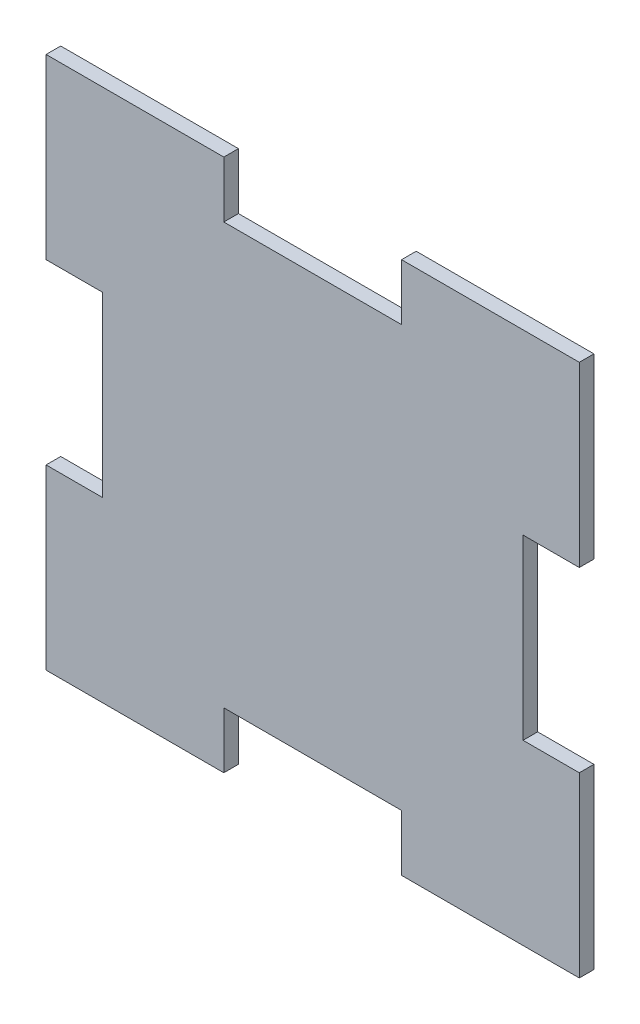
ISO-10303-21;
HEADER;
FILE_DESCRIPTION(('STEP AP214'),'2;1');
FILE_NAME('part.step','',(''),(''),'','','');
FILE_SCHEMA(('AUTOMOTIVE_DESIGN { 1 0 10303 214 1 1 1 1 }'));
ENDSEC;
DATA;
#1=APPLICATION_CONTEXT('core data for automotive mechanical design processes');
#2=APPLICATION_PROTOCOL_DEFINITION('international standard','automotive_design',2000,#1);
#3=PRODUCT_CONTEXT('',#1,'mechanical');
#4=PRODUCT('Part','Part','',(#3));
#5=PRODUCT_RELATED_PRODUCT_CATEGORY('part','',(#4));
#6=PRODUCT_DEFINITION_FORMATION('','',#4);
#7=PRODUCT_DEFINITION_CONTEXT('part definition',#1,'design');
#8=PRODUCT_DEFINITION('design','',#6,#7);
#9=PRODUCT_DEFINITION_SHAPE('','',#8);
#10=(LENGTH_UNIT() NAMED_UNIT(*) SI_UNIT(.MILLI.,.METRE.));
#11=(NAMED_UNIT(*) PLANE_ANGLE_UNIT() SI_UNIT($,.RADIAN.));
#12=(NAMED_UNIT(*) SI_UNIT($,.STERADIAN.) SOLID_ANGLE_UNIT());
#13=UNCERTAINTY_MEASURE_WITH_UNIT(LENGTH_MEASURE(1.E-05),#10,'distance_accuracy_value','');
#14=(GEOMETRIC_REPRESENTATION_CONTEXT(3) GLOBAL_UNCERTAINTY_ASSIGNED_CONTEXT((#13)) GLOBAL_UNIT_ASSIGNED_CONTEXT((#10,
#11,#12)) REPRESENTATION_CONTEXT('',''));
#15=CARTESIAN_POINT('',(0.,0.,0.));
#16=DIRECTION('',(0.,0.,1.));
#17=DIRECTION('',(1.,0.,0.));
#18=AXIS2_PLACEMENT_3D('',#15,#16,#17);
#19=CARTESIAN_POINT('',(95.9203819214755,2.31764716104696,2.6));
#20=DIRECTION('',(0.,1.,0.));
#21=DIRECTION('',(-1.,0.,0.));
#22=AXIS2_PLACEMENT_3D('',#19,#20,#21);
#23=PLANE('',#22);
#24=DIRECTION('',(1.,0.,0.));
#25=VECTOR('',#24,1.);
#26=CARTESIAN_POINT('',(95.9203819214755,2.31764716104696,0.));
#27=LINE('',#26,#25);
#28=CARTESIAN_POINT('',(1.1203819214755,2.31764716104696,0.));
#29=VERTEX_POINT('',#28);
#30=CARTESIAN_POINT('',(32.7203819214755,2.31764716104697,0.));
#31=VERTEX_POINT('',#30);
#32=EDGE_CURVE('E183',#29,#31,#27,.T.);
#33=ORIENTED_EDGE('',*,*,#32,.T.);
#34=DIRECTION('',(0.,0.,1.));
#35=VECTOR('',#34,1.);
#36=CARTESIAN_POINT('',(32.7203819214755,2.31764716104697,0.));
#37=LINE('',#36,#35);
#38=CARTESIAN_POINT('',(32.7203819214755,2.31764716104697,2.6));
#39=VERTEX_POINT('',#38);
#40=EDGE_CURVE('E167',#31,#39,#37,.T.);
#41=ORIENTED_EDGE('',*,*,#40,.T.);
#42=DIRECTION('',(1.,0.,0.));
#43=VECTOR('',#42,1.);
#44=CARTESIAN_POINT('',(1.1203819214755,2.31764716104696,2.6));
#45=LINE('',#44,#43);
#46=CARTESIAN_POINT('',(1.1203819214755,2.31764716104696,2.6));
#47=VERTEX_POINT('',#46);
#48=EDGE_CURVE('E203',#47,#39,#45,.T.);
#49=ORIENTED_EDGE('',*,*,#48,.F.);
#50=DIRECTION('',(0.,0.,-1.));
#51=VECTOR('',#50,1.);
#52=CARTESIAN_POINT('',(1.1203819214755,2.31764716104696,2.6));
#53=LINE('',#52,#51);
#54=EDGE_CURVE('E190',#47,#29,#53,.T.);
#55=ORIENTED_EDGE('',*,*,#54,.T.);
#56=EDGE_LOOP('',(#33,#41,#49,#55));
#57=FACE_BOUND('',#56,.T.);
#58=ADVANCED_FACE('F30',(#57),#23,.F.);
#59=CARTESIAN_POINT('',(1.1203819214755,97.117647161047,2.6));
#60=DIRECTION('',(0.,-1.,0.));
#61=DIRECTION('',(1.,0.,0.));
#62=AXIS2_PLACEMENT_3D('',#59,#60,#61);
#63=PLANE('',#62);
#64=DIRECTION('',(-1.,0.,0.));
#65=VECTOR('',#64,1.);
#66=CARTESIAN_POINT('',(95.9203819214755,97.117647161047,2.6));
#67=LINE('',#66,#65);
#68=CARTESIAN_POINT('',(32.7203819214755,97.117647161047,2.6));
#69=VERTEX_POINT('',#68);
#70=CARTESIAN_POINT('',(1.1203819214755,97.117647161047,2.6));
#71=VERTEX_POINT('',#70);
#72=EDGE_CURVE('E218',#69,#71,#67,.T.);
#73=ORIENTED_EDGE('',*,*,#72,.F.);
#74=DIRECTION('',(0.,0.,1.));
#75=VECTOR('',#74,1.);
#76=CARTESIAN_POINT('',(32.7203819214755,97.117647161047,0.));
#77=LINE('',#76,#75);
#78=CARTESIAN_POINT('',(32.7203819214755,97.117647161047,0.));
#79=VERTEX_POINT('',#78);
#80=EDGE_CURVE('E221',#79,#69,#77,.T.);
#81=ORIENTED_EDGE('',*,*,#80,.F.);
#82=DIRECTION('',(-1.,0.,0.));
#83=VECTOR('',#82,1.);
#84=CARTESIAN_POINT('',(1.1203819214755,97.117647161047,0.));
#85=LINE('',#84,#83);
#86=CARTESIAN_POINT('',(1.1203819214755,97.117647161047,0.));
#87=VERTEX_POINT('',#86);
#88=EDGE_CURVE('E220',#79,#87,#85,.T.);
#89=ORIENTED_EDGE('',*,*,#88,.T.);
#90=DIRECTION('',(0.,0.,-1.));
#91=VECTOR('',#90,1.);
#92=CARTESIAN_POINT('',(1.1203819214755,97.117647161047,2.6));
#93=LINE('',#92,#91);
#94=EDGE_CURVE('E38',#71,#87,#93,.T.);
#95=ORIENTED_EDGE('',*,*,#94,.F.);
#96=EDGE_LOOP('',(#73,#81,#89,#95));
#97=FACE_BOUND('',#96,.T.);
#98=ADVANCED_FACE('F216',(#97),#63,.F.);
#99=CARTESIAN_POINT('',(1.1203819214755,2.31764716104696,2.6));
#100=DIRECTION('',(1.,0.,0.));
#101=DIRECTION('',(0.,1.,0.));
#102=AXIS2_PLACEMENT_3D('',#99,#100,#101);
#103=PLANE('',#102);
#104=DIRECTION('',(0.,-1.,0.));
#105=VECTOR('',#104,1.);
#106=CARTESIAN_POINT('',(1.1203819214755,97.117647161047,2.6));
#107=LINE('',#106,#105);
#108=CARTESIAN_POINT('',(1.1203819214755,33.917647161047,2.6));
#109=VERTEX_POINT('',#108);
#110=EDGE_CURVE('E242',#109,#47,#107,.T.);
#111=ORIENTED_EDGE('',*,*,#110,.F.);
#112=DIRECTION('',(0.,0.,1.));
#113=VECTOR('',#112,1.);
#114=CARTESIAN_POINT('',(1.1203819214755,33.917647161047,0.));
#115=LINE('',#114,#113);
#116=CARTESIAN_POINT('',(1.1203819214755,33.917647161047,0.));
#117=VERTEX_POINT('',#116);
#118=EDGE_CURVE('E266',#117,#109,#115,.T.);
#119=ORIENTED_EDGE('',*,*,#118,.F.);
#120=DIRECTION('',(0.,-1.,0.));
#121=VECTOR('',#120,1.);
#122=CARTESIAN_POINT('',(1.1203819214755,2.31764716104696,0.));
#123=LINE('',#122,#121);
#124=EDGE_CURVE('E228',#117,#29,#123,.T.);
#125=ORIENTED_EDGE('',*,*,#124,.T.);
#126=ORIENTED_EDGE('',*,*,#54,.F.);
#127=EDGE_LOOP('',(#111,#119,#125,#126));
#128=FACE_BOUND('',#127,.T.);
#129=ADVANCED_FACE('F358',(#128),#103,.F.);
#130=CARTESIAN_POINT('',(95.9203819214755,97.117647161047,2.6));
#131=DIRECTION('',(-1.,0.,0.));
#132=DIRECTION('',(0.,-1.,0.));
#133=AXIS2_PLACEMENT_3D('',#130,#131,#132);
#134=PLANE('',#133);
#135=DIRECTION('',(0.,1.,0.));
#136=VECTOR('',#135,1.);
#137=CARTESIAN_POINT('',(95.9203819214755,32.237647161047,2.6));
#138=LINE('',#137,#136);
#139=CARTESIAN_POINT('',(95.9203819214755,65.517647161047,2.6));
#140=VERTEX_POINT('',#139);
#141=CARTESIAN_POINT('',(95.9203819214755,97.117647161047,2.6));
#142=VERTEX_POINT('',#141);
#143=EDGE_CURVE('E191',#140,#142,#138,.T.);
#144=ORIENTED_EDGE('',*,*,#143,.F.);
#145=DIRECTION('',(0.,0.,1.));
#146=VECTOR('',#145,1.);
#147=CARTESIAN_POINT('',(95.9203819214755,65.517647161047,0.));
#148=LINE('',#147,#146);
#149=CARTESIAN_POINT('',(95.9203819214755,65.517647161047,0.));
#150=VERTEX_POINT('',#149);
#151=EDGE_CURVE('E253',#150,#140,#148,.T.);
#152=ORIENTED_EDGE('',*,*,#151,.F.);
#153=DIRECTION('',(0.,1.,0.));
#154=VECTOR('',#153,1.);
#155=CARTESIAN_POINT('',(95.9203819214755,97.117647161047,0.));
#156=LINE('',#155,#154);
#157=CARTESIAN_POINT('',(95.9203819214755,97.117647161047,0.));
#158=VERTEX_POINT('',#157);
#159=EDGE_CURVE('E238',#150,#158,#156,.T.);
#160=ORIENTED_EDGE('',*,*,#159,.T.);
#161=DIRECTION('',(0.,0.,-1.));
#162=VECTOR('',#161,1.);
#163=CARTESIAN_POINT('',(95.9203819214755,97.117647161047,2.6));
#164=LINE('',#163,#162);
#165=EDGE_CURVE('E11',#142,#158,#164,.T.);
#166=ORIENTED_EDGE('',*,*,#165,.F.);
#167=EDGE_LOOP('',(#144,#152,#160,#166));
#168=FACE_BOUND('',#167,.T.);
#169=ADVANCED_FACE('F372',(#168),#134,.F.);
#170=CARTESIAN_POINT('',(95.9203819214755,2.31764716104696,0.));
#171=VERTEX_POINT('',#170);
#172=CARTESIAN_POINT('',(95.9203819214755,33.917647161047,0.));
#173=VERTEX_POINT('',#172);
#174=EDGE_CURVE('E224',#171,#173,#156,.T.);
#175=ORIENTED_EDGE('',*,*,#174,.T.);
#176=DIRECTION('',(0.,0.,1.));
#177=VECTOR('',#176,1.);
#178=CARTESIAN_POINT('',(95.9203819214755,33.917647161047,0.));
#179=LINE('',#178,#177);
#180=CARTESIAN_POINT('',(95.9203819214755,33.917647161047,2.6));
#181=VERTEX_POINT('',#180);
#182=EDGE_CURVE('E249',#173,#181,#179,.T.);
#183=ORIENTED_EDGE('',*,*,#182,.T.);
#184=CARTESIAN_POINT('',(95.9203819214755,2.31764716104696,2.6));
#185=VERTEX_POINT('',#184);
#186=EDGE_CURVE('E194',#185,#181,#138,.T.);
#187=ORIENTED_EDGE('',*,*,#186,.F.);
#188=DIRECTION('',(0.,0.,-1.));
#189=VECTOR('',#188,1.);
#190=CARTESIAN_POINT('',(95.9203819214755,2.31764716104696,2.6));
#191=LINE('',#190,#189);
#192=EDGE_CURVE('E200',#185,#171,#191,.T.);
#193=ORIENTED_EDGE('',*,*,#192,.T.);
#194=EDGE_LOOP('',(#175,#183,#187,#193));
#195=FACE_BOUND('',#194,.T.);
#196=ADVANCED_FACE('F32',(#195),#134,.F.);
#197=CARTESIAN_POINT('',(64.3203819214755,97.117647161047,0.));
#198=VERTEX_POINT('',#197);
#199=EDGE_CURVE('E223',#158,#198,#85,.T.);
#200=ORIENTED_EDGE('',*,*,#199,.T.);
#201=DIRECTION('',(0.,0.,1.));
#202=VECTOR('',#201,1.);
#203=CARTESIAN_POINT('',(64.3203819214755,97.117647161047,0.));
#204=LINE('',#203,#202);
#205=CARTESIAN_POINT('',(64.3203819214755,97.117647161047,2.6));
#206=VERTEX_POINT('',#205);
#207=EDGE_CURVE('E299',#198,#206,#204,.T.);
#208=ORIENTED_EDGE('',*,*,#207,.T.);
#209=EDGE_CURVE('E243',#142,#206,#67,.T.);
#210=ORIENTED_EDGE('',*,*,#209,.F.);
#211=ORIENTED_EDGE('',*,*,#165,.T.);
#212=EDGE_LOOP('',(#200,#208,#210,#211));
#213=FACE_BOUND('',#212,.T.);
#214=ADVANCED_FACE('F359',(#213),#63,.F.);
#215=CARTESIAN_POINT('',(1.1203819214755,65.517647161047,0.));
#216=VERTEX_POINT('',#215);
#217=EDGE_CURVE('E196',#87,#216,#123,.T.);
#218=ORIENTED_EDGE('',*,*,#217,.T.);
#219=DIRECTION('',(0.,0.,1.));
#220=VECTOR('',#219,1.);
#221=CARTESIAN_POINT('',(1.1203819214755,65.517647161047,0.));
#222=LINE('',#221,#220);
#223=CARTESIAN_POINT('',(1.1203819214755,65.517647161047,2.6));
#224=VERTEX_POINT('',#223);
#225=EDGE_CURVE('E278',#216,#224,#222,.T.);
#226=ORIENTED_EDGE('',*,*,#225,.T.);
#227=EDGE_CURVE('E213',#71,#224,#107,.T.);
#228=ORIENTED_EDGE('',*,*,#227,.F.);
#229=ORIENTED_EDGE('',*,*,#94,.T.);
#230=EDGE_LOOP('',(#218,#226,#228,#229));
#231=FACE_BOUND('',#230,.T.);
#232=ADVANCED_FACE('F209',(#231),#103,.F.);
#233=CARTESIAN_POINT('',(64.3203819214755,2.31764716104697,2.6));
#234=VERTEX_POINT('',#233);
#235=EDGE_CURVE('E240',#234,#185,#45,.T.);
#236=ORIENTED_EDGE('',*,*,#235,.F.);
#237=DIRECTION('',(0.,0.,1.));
#238=VECTOR('',#237,1.);
#239=CARTESIAN_POINT('',(64.3203819214755,2.31764716104697,0.));
#240=LINE('',#239,#238);
#241=CARTESIAN_POINT('',(64.3203819214755,2.31764716104697,0.));
#242=VERTEX_POINT('',#241);
#243=EDGE_CURVE('E177',#242,#234,#240,.T.);
#244=ORIENTED_EDGE('',*,*,#243,.F.);
#245=EDGE_CURVE('E192',#242,#171,#27,.T.);
#246=ORIENTED_EDGE('',*,*,#245,.T.);
#247=ORIENTED_EDGE('',*,*,#192,.F.);
#248=EDGE_LOOP('',(#236,#244,#246,#247));
#249=FACE_BOUND('',#248,.T.);
#250=ADVANCED_FACE('F336',(#249),#23,.F.);
#251=CARTESIAN_POINT('',(95.9203819214755,2.31764716104696,2.6));
#252=DIRECTION('',(0.,0.,-1.));
#253=DIRECTION('',(-1.,0.,0.));
#254=AXIS2_PLACEMENT_3D('',#251,#252,#253);
#255=PLANE('',#254);
#256=ORIENTED_EDGE('',*,*,#48,.T.);
#257=DIRECTION('',(0.,-1.,0.));
#258=VECTOR('',#257,1.);
#259=CARTESIAN_POINT('',(32.7203819214755,2.31764716104697,2.6));
#260=LINE('',#259,#258);
#261=CARTESIAN_POINT('',(32.7203819214755,12.317647161047,2.6));
#262=VERTEX_POINT('',#261);
#263=EDGE_CURVE('E172',#262,#39,#260,.T.);
#264=ORIENTED_EDGE('',*,*,#263,.F.);
#265=DIRECTION('',(-1.,0.,0.));
#266=VECTOR('',#265,1.);
#267=CARTESIAN_POINT('',(32.7203819214755,12.317647161047,2.6));
#268=LINE('',#267,#266);
#269=CARTESIAN_POINT('',(64.3203819214755,12.317647161047,2.6));
#270=VERTEX_POINT('',#269);
#271=EDGE_CURVE('E187',#270,#262,#268,.T.);
#272=ORIENTED_EDGE('',*,*,#271,.F.);
#273=DIRECTION('',(0.,1.,0.));
#274=VECTOR('',#273,1.);
#275=CARTESIAN_POINT('',(64.3203819214755,2.31764716104697,2.6));
#276=LINE('',#275,#274);
#277=EDGE_CURVE('E323',#234,#270,#276,.T.);
#278=ORIENTED_EDGE('',*,*,#277,.F.);
#279=ORIENTED_EDGE('',*,*,#235,.T.);
#280=ORIENTED_EDGE('',*,*,#186,.T.);
#281=DIRECTION('',(1.,0.,0.));
#282=VECTOR('',#281,1.);
#283=CARTESIAN_POINT('',(95.9203819214755,33.917647161047,2.6));
#284=LINE('',#283,#282);
#285=CARTESIAN_POINT('',(85.9203819214755,33.917647161047,2.6));
#286=VERTEX_POINT('',#285);
#287=EDGE_CURVE('E261',#286,#181,#284,.T.);
#288=ORIENTED_EDGE('',*,*,#287,.F.);
#289=DIRECTION('',(0.,-1.,0.));
#290=VECTOR('',#289,1.);
#291=CARTESIAN_POINT('',(85.9203819214755,33.917647161047,2.6));
#292=LINE('',#291,#290);
#293=CARTESIAN_POINT('',(85.9203819214755,65.517647161047,2.6));
#294=VERTEX_POINT('',#293);
#295=EDGE_CURVE('E263',#294,#286,#292,.T.);
#296=ORIENTED_EDGE('',*,*,#295,.F.);
#297=DIRECTION('',(-1.,0.,0.));
#298=VECTOR('',#297,1.);
#299=CARTESIAN_POINT('',(95.9203819214755,65.517647161047,2.6));
#300=LINE('',#299,#298);
#301=EDGE_CURVE('E257',#140,#294,#300,.T.);
#302=ORIENTED_EDGE('',*,*,#301,.F.);
#303=ORIENTED_EDGE('',*,*,#143,.T.);
#304=ORIENTED_EDGE('',*,*,#209,.T.);
#305=DIRECTION('',(0.,1.,0.));
#306=VECTOR('',#305,1.);
#307=CARTESIAN_POINT('',(64.3203819214755,97.117647161047,2.6));
#308=LINE('',#307,#306);
#309=CARTESIAN_POINT('',(64.3203819214755,87.117647161047,2.6));
#310=VERTEX_POINT('',#309);
#311=EDGE_CURVE('E302',#310,#206,#308,.T.);
#312=ORIENTED_EDGE('',*,*,#311,.F.);
#313=DIRECTION('',(1.,0.,0.));
#314=VECTOR('',#313,1.);
#315=CARTESIAN_POINT('',(32.7203819214755,87.117647161047,2.6));
#316=LINE('',#315,#314);
#317=CARTESIAN_POINT('',(32.7203819214755,87.117647161047,2.6));
#318=VERTEX_POINT('',#317);
#319=EDGE_CURVE('E305',#318,#310,#316,.T.);
#320=ORIENTED_EDGE('',*,*,#319,.F.);
#321=DIRECTION('',(0.,-1.,0.));
#322=VECTOR('',#321,1.);
#323=CARTESIAN_POINT('',(32.7203819214755,97.117647161047,2.6));
#324=LINE('',#323,#322);
#325=EDGE_CURVE('E308',#69,#318,#324,.T.);
#326=ORIENTED_EDGE('',*,*,#325,.F.);
#327=ORIENTED_EDGE('',*,*,#72,.T.);
#328=ORIENTED_EDGE('',*,*,#227,.T.);
#329=DIRECTION('',(-1.,0.,0.));
#330=VECTOR('',#329,1.);
#331=CARTESIAN_POINT('',(1.1203819214755,65.517647161047,2.6));
#332=LINE('',#331,#330);
#333=CARTESIAN_POINT('',(11.1203819214755,65.517647161047,2.6));
#334=VERTEX_POINT('',#333);
#335=EDGE_CURVE('E281',#334,#224,#332,.T.);
#336=ORIENTED_EDGE('',*,*,#335,.F.);
#337=DIRECTION('',(0.,1.,0.));
#338=VECTOR('',#337,1.);
#339=CARTESIAN_POINT('',(11.1203819214755,33.917647161047,2.6));
#340=LINE('',#339,#338);
#341=CARTESIAN_POINT('',(11.1203819214755,33.917647161047,2.6));
#342=VERTEX_POINT('',#341);
#343=EDGE_CURVE('E284',#342,#334,#340,.T.);
#344=ORIENTED_EDGE('',*,*,#343,.F.);
#345=DIRECTION('',(1.,0.,0.));
#346=VECTOR('',#345,1.);
#347=CARTESIAN_POINT('',(1.1203819214755,33.917647161047,2.6));
#348=LINE('',#347,#346);
#349=EDGE_CURVE('E287',#109,#342,#348,.T.);
#350=ORIENTED_EDGE('',*,*,#349,.F.);
#351=ORIENTED_EDGE('',*,*,#110,.T.);
#352=EDGE_LOOP('',(#256,#264,#272,#278,#279,#280,#288,#296,#302,#303,#304,#312,#320,#326,#327,
#328,#336,#344,#350,#351));
#353=FACE_BOUND('',#352,.T.);
#354=ADVANCED_FACE('F340',(#353),#255,.F.);
#355=CARTESIAN_POINT('',(95.9203819214755,2.31764716104696,0.));
#356=DIRECTION('',(0.,0.,-1.));
#357=DIRECTION('',(-1.,0.,0.));
#358=AXIS2_PLACEMENT_3D('',#355,#356,#357);
#359=PLANE('',#358);
#360=DIRECTION('',(0.,-1.,0.));
#361=VECTOR('',#360,1.);
#362=CARTESIAN_POINT('',(32.7203819214755,2.31764716104697,0.));
#363=LINE('',#362,#361);
#364=CARTESIAN_POINT('',(32.7203819214755,12.317647161047,0.));
#365=VERTEX_POINT('',#364);
#366=EDGE_CURVE('E170',#365,#31,#363,.T.);
#367=ORIENTED_EDGE('',*,*,#366,.T.);
#368=ORIENTED_EDGE('',*,*,#32,.F.);
#369=ORIENTED_EDGE('',*,*,#124,.F.);
#370=DIRECTION('',(1.,0.,0.));
#371=VECTOR('',#370,1.);
#372=CARTESIAN_POINT('',(1.1203819214755,33.917647161047,0.));
#373=LINE('',#372,#371);
#374=CARTESIAN_POINT('',(11.1203819214755,33.917647161047,0.));
#375=VERTEX_POINT('',#374);
#376=EDGE_CURVE('E283',#117,#375,#373,.T.);
#377=ORIENTED_EDGE('',*,*,#376,.T.);
#378=DIRECTION('',(0.,1.,0.));
#379=VECTOR('',#378,1.);
#380=CARTESIAN_POINT('',(11.1203819214755,33.917647161047,0.));
#381=LINE('',#380,#379);
#382=CARTESIAN_POINT('',(11.1203819214755,65.517647161047,0.));
#383=VERTEX_POINT('',#382);
#384=EDGE_CURVE('E291',#375,#383,#381,.T.);
#385=ORIENTED_EDGE('',*,*,#384,.T.);
#386=DIRECTION('',(-1.,0.,0.));
#387=VECTOR('',#386,1.);
#388=CARTESIAN_POINT('',(1.1203819214755,65.517647161047,0.));
#389=LINE('',#388,#387);
#390=EDGE_CURVE('E227',#383,#216,#389,.T.);
#391=ORIENTED_EDGE('',*,*,#390,.T.);
#392=ORIENTED_EDGE('',*,*,#217,.F.);
#393=ORIENTED_EDGE('',*,*,#88,.F.);
#394=DIRECTION('',(0.,-1.,0.));
#395=VECTOR('',#394,1.);
#396=CARTESIAN_POINT('',(32.7203819214755,97.117647161047,0.));
#397=LINE('',#396,#395);
#398=CARTESIAN_POINT('',(32.7203819214755,87.117647161047,0.));
#399=VERTEX_POINT('',#398);
#400=EDGE_CURVE('E304',#79,#399,#397,.T.);
#401=ORIENTED_EDGE('',*,*,#400,.T.);
#402=DIRECTION('',(1.,0.,0.));
#403=VECTOR('',#402,1.);
#404=CARTESIAN_POINT('',(32.7203819214755,87.117647161047,0.));
#405=LINE('',#404,#403);
#406=CARTESIAN_POINT('',(64.3203819214755,87.117647161047,0.));
#407=VERTEX_POINT('',#406);
#408=EDGE_CURVE('E313',#399,#407,#405,.T.);
#409=ORIENTED_EDGE('',*,*,#408,.T.);
#410=DIRECTION('',(0.,1.,0.));
#411=VECTOR('',#410,1.);
#412=CARTESIAN_POINT('',(64.3203819214755,97.117647161047,0.));
#413=LINE('',#412,#411);
#414=EDGE_CURVE('E53',#407,#198,#413,.T.);
#415=ORIENTED_EDGE('',*,*,#414,.T.);
#416=ORIENTED_EDGE('',*,*,#199,.F.);
#417=ORIENTED_EDGE('',*,*,#159,.F.);
#418=DIRECTION('',(-1.,0.,0.));
#419=VECTOR('',#418,1.);
#420=CARTESIAN_POINT('',(95.9203819214755,65.517647161047,0.));
#421=LINE('',#420,#419);
#422=CARTESIAN_POINT('',(85.9203819214755,65.517647161047,0.));
#423=VERTEX_POINT('',#422);
#424=EDGE_CURVE('E250',#150,#423,#421,.T.);
#425=ORIENTED_EDGE('',*,*,#424,.T.);
#426=DIRECTION('',(0.,-1.,0.));
#427=VECTOR('',#426,1.);
#428=CARTESIAN_POINT('',(85.9203819214755,33.917647161047,0.));
#429=LINE('',#428,#427);
#430=CARTESIAN_POINT('',(85.9203819214755,33.917647161047,0.));
#431=VERTEX_POINT('',#430);
#432=EDGE_CURVE('E260',#423,#431,#429,.T.);
#433=ORIENTED_EDGE('',*,*,#432,.T.);
#434=DIRECTION('',(1.,0.,0.));
#435=VECTOR('',#434,1.);
#436=CARTESIAN_POINT('',(95.9203819214755,33.917647161047,0.));
#437=LINE('',#436,#435);
#438=EDGE_CURVE('E269',#431,#173,#437,.T.);
#439=ORIENTED_EDGE('',*,*,#438,.T.);
#440=ORIENTED_EDGE('',*,*,#174,.F.);
#441=ORIENTED_EDGE('',*,*,#245,.F.);
#442=DIRECTION('',(0.,1.,0.));
#443=VECTOR('',#442,1.);
#444=CARTESIAN_POINT('',(64.3203819214755,2.31764716104697,0.));
#445=LINE('',#444,#443);
#446=CARTESIAN_POINT('',(64.3203819214755,12.317647161047,0.));
#447=VERTEX_POINT('',#446);
#448=EDGE_CURVE('E186',#242,#447,#445,.T.);
#449=ORIENTED_EDGE('',*,*,#448,.T.);
#450=DIRECTION('',(-1.,0.,0.));
#451=VECTOR('',#450,1.);
#452=CARTESIAN_POINT('',(32.7203819214755,12.317647161047,0.));
#453=LINE('',#452,#451);
#454=EDGE_CURVE('E45',#447,#365,#453,.T.);
#455=ORIENTED_EDGE('',*,*,#454,.T.);
#456=EDGE_LOOP('',(#367,#368,#369,#377,#385,#391,#392,#393,#401,#409,#415,#416,#417,#425,#433,
#439,#440,#441,#449,#455));
#457=FACE_BOUND('',#456,.T.);
#458=ADVANCED_FACE('F181',(#457),#359,.T.);
#459=CARTESIAN_POINT('',(85.9203819214755,33.917647161047,0.));
#460=DIRECTION('',(-1.,0.,0.));
#461=DIRECTION('',(0.,0.,1.));
#462=AXIS2_PLACEMENT_3D('',#459,#460,#461);
#463=PLANE('',#462);
#464=ORIENTED_EDGE('',*,*,#295,.T.);
#465=DIRECTION('',(0.,0.,1.));
#466=VECTOR('',#465,1.);
#467=CARTESIAN_POINT('',(85.9203819214755,33.917647161047,0.));
#468=LINE('',#467,#466);
#469=EDGE_CURVE('E247',#431,#286,#468,.T.);
#470=ORIENTED_EDGE('',*,*,#469,.F.);
#471=ORIENTED_EDGE('',*,*,#432,.F.);
#472=DIRECTION('',(0.,0.,1.));
#473=VECTOR('',#472,1.);
#474=CARTESIAN_POINT('',(85.9203819214755,65.517647161047,0.));
#475=LINE('',#474,#473);
#476=EDGE_CURVE('E255',#423,#294,#475,.T.);
#477=ORIENTED_EDGE('',*,*,#476,.T.);
#478=EDGE_LOOP('',(#464,#470,#471,#477));
#479=FACE_BOUND('',#478,.T.);
#480=ADVANCED_FACE('F408',(#479),#463,.F.);
#481=CARTESIAN_POINT('',(95.9203819214755,65.517647161047,0.));
#482=DIRECTION('',(0.,1.,0.));
#483=DIRECTION('',(-1.,0.,0.));
#484=AXIS2_PLACEMENT_3D('',#481,#482,#483);
#485=PLANE('',#484);
#486=ORIENTED_EDGE('',*,*,#301,.T.);
#487=ORIENTED_EDGE('',*,*,#476,.F.);
#488=ORIENTED_EDGE('',*,*,#424,.F.);
#489=ORIENTED_EDGE('',*,*,#151,.T.);
#490=EDGE_LOOP('',(#486,#487,#488,#489));
#491=FACE_BOUND('',#490,.T.);
#492=ADVANCED_FACE('F406',(#491),#485,.F.);
#493=CARTESIAN_POINT('',(95.9203819214755,33.917647161047,0.));
#494=DIRECTION('',(0.,-1.,0.));
#495=DIRECTION('',(1.,0.,0.));
#496=AXIS2_PLACEMENT_3D('',#493,#494,#495);
#497=PLANE('',#496);
#498=ORIENTED_EDGE('',*,*,#287,.T.);
#499=ORIENTED_EDGE('',*,*,#182,.F.);
#500=ORIENTED_EDGE('',*,*,#438,.F.);
#501=ORIENTED_EDGE('',*,*,#469,.T.);
#502=EDGE_LOOP('',(#498,#499,#500,#501));
#503=FACE_BOUND('',#502,.T.);
#504=ADVANCED_FACE('F411',(#503),#497,.F.);
#505=CARTESIAN_POINT('',(1.1203819214755,33.917647161047,0.));
#506=DIRECTION('',(0.,-1.,0.));
#507=DIRECTION('',(1.,0.,0.));
#508=AXIS2_PLACEMENT_3D('',#505,#506,#507);
#509=PLANE('',#508);
#510=ORIENTED_EDGE('',*,*,#349,.T.);
#511=DIRECTION('',(0.,0.,1.));
#512=VECTOR('',#511,1.);
#513=CARTESIAN_POINT('',(11.1203819214755,33.917647161047,0.));
#514=LINE('',#513,#512);
#515=EDGE_CURVE('E274',#375,#342,#514,.T.);
#516=ORIENTED_EDGE('',*,*,#515,.F.);
#517=ORIENTED_EDGE('',*,*,#376,.F.);
#518=ORIENTED_EDGE('',*,*,#118,.T.);
#519=EDGE_LOOP('',(#510,#516,#517,#518));
#520=FACE_BOUND('',#519,.T.);
#521=ADVANCED_FACE('F382',(#520),#509,.F.);
#522=CARTESIAN_POINT('',(1.1203819214755,65.517647161047,0.));
#523=DIRECTION('',(0.,1.,0.));
#524=DIRECTION('',(-1.,0.,0.));
#525=AXIS2_PLACEMENT_3D('',#522,#523,#524);
#526=PLANE('',#525);
#527=ORIENTED_EDGE('',*,*,#335,.T.);
#528=ORIENTED_EDGE('',*,*,#225,.F.);
#529=ORIENTED_EDGE('',*,*,#390,.F.);
#530=DIRECTION('',(0.,0.,1.));
#531=VECTOR('',#530,1.);
#532=CARTESIAN_POINT('',(11.1203819214755,65.517647161047,0.));
#533=LINE('',#532,#531);
#534=EDGE_CURVE('E276',#383,#334,#533,.T.);
#535=ORIENTED_EDGE('',*,*,#534,.T.);
#536=EDGE_LOOP('',(#527,#528,#529,#535));
#537=FACE_BOUND('',#536,.T.);
#538=ADVANCED_FACE('F388',(#537),#526,.F.);
#539=CARTESIAN_POINT('',(11.1203819214755,33.917647161047,0.));
#540=DIRECTION('',(1.,0.,0.));
#541=DIRECTION('',(0.,0.,-1.));
#542=AXIS2_PLACEMENT_3D('',#539,#540,#541);
#543=PLANE('',#542);
#544=ORIENTED_EDGE('',*,*,#343,.T.);
#545=ORIENTED_EDGE('',*,*,#534,.F.);
#546=ORIENTED_EDGE('',*,*,#384,.F.);
#547=ORIENTED_EDGE('',*,*,#515,.T.);
#548=EDGE_LOOP('',(#544,#545,#546,#547));
#549=FACE_BOUND('',#548,.T.);
#550=ADVANCED_FACE('F386',(#549),#543,.F.);
#551=CARTESIAN_POINT('',(32.7203819214755,97.117647161047,0.));
#552=DIRECTION('',(-1.,0.,0.));
#553=DIRECTION('',(0.,0.,1.));
#554=AXIS2_PLACEMENT_3D('',#551,#552,#553);
#555=PLANE('',#554);
#556=ORIENTED_EDGE('',*,*,#325,.T.);
#557=DIRECTION('',(0.,0.,1.));
#558=VECTOR('',#557,1.);
#559=CARTESIAN_POINT('',(32.7203819214755,87.117647161047,0.));
#560=LINE('',#559,#558);
#561=EDGE_CURVE('E295',#399,#318,#560,.T.);
#562=ORIENTED_EDGE('',*,*,#561,.F.);
#563=ORIENTED_EDGE('',*,*,#400,.F.);
#564=ORIENTED_EDGE('',*,*,#80,.T.);
#565=EDGE_LOOP('',(#556,#562,#563,#564));
#566=FACE_BOUND('',#565,.T.);
#567=ADVANCED_FACE('F393',(#566),#555,.F.);
#568=CARTESIAN_POINT('',(64.3203819214755,97.117647161047,0.));
#569=DIRECTION('',(1.,0.,0.));
#570=DIRECTION('',(0.,0.,-1.));
#571=AXIS2_PLACEMENT_3D('',#568,#569,#570);
#572=PLANE('',#571);
#573=ORIENTED_EDGE('',*,*,#311,.T.);
#574=ORIENTED_EDGE('',*,*,#207,.F.);
#575=ORIENTED_EDGE('',*,*,#414,.F.);
#576=DIRECTION('',(0.,0.,1.));
#577=VECTOR('',#576,1.);
#578=CARTESIAN_POINT('',(64.3203819214755,87.117647161047,0.));
#579=LINE('',#578,#577);
#580=EDGE_CURVE('E297',#407,#310,#579,.T.);
#581=ORIENTED_EDGE('',*,*,#580,.T.);
#582=EDGE_LOOP('',(#573,#574,#575,#581));
#583=FACE_BOUND('',#582,.T.);
#584=ADVANCED_FACE('F396',(#583),#572,.F.);
#585=CARTESIAN_POINT('',(32.7203819214755,87.117647161047,0.));
#586=DIRECTION('',(0.,-1.,0.));
#587=DIRECTION('',(0.,0.,-1.));
#588=AXIS2_PLACEMENT_3D('',#585,#586,#587);
#589=PLANE('',#588);
#590=ORIENTED_EDGE('',*,*,#319,.T.);
#591=ORIENTED_EDGE('',*,*,#580,.F.);
#592=ORIENTED_EDGE('',*,*,#408,.F.);
#593=ORIENTED_EDGE('',*,*,#561,.T.);
#594=EDGE_LOOP('',(#590,#591,#592,#593));
#595=FACE_BOUND('',#594,.T.);
#596=ADVANCED_FACE('F351',(#595),#589,.F.);
#597=CARTESIAN_POINT('',(32.7203819214755,2.31764716104697,0.));
#598=DIRECTION('',(-1.,0.,0.));
#599=DIRECTION('',(0.,-1.,0.));
#600=AXIS2_PLACEMENT_3D('',#597,#598,#599);
#601=PLANE('',#600);
#602=ORIENTED_EDGE('',*,*,#263,.T.);
#603=ORIENTED_EDGE('',*,*,#40,.F.);
#604=ORIENTED_EDGE('',*,*,#366,.F.);
#605=DIRECTION('',(0.,0.,1.));
#606=VECTOR('',#605,1.);
#607=CARTESIAN_POINT('',(32.7203819214755,12.317647161047,0.));
#608=LINE('',#607,#606);
#609=EDGE_CURVE('E311',#365,#262,#608,.T.);
#610=ORIENTED_EDGE('',*,*,#609,.T.);
#611=EDGE_LOOP('',(#602,#603,#604,#610));
#612=FACE_BOUND('',#611,.T.);
#613=ADVANCED_FACE('F169',(#612),#601,.F.);
#614=CARTESIAN_POINT('',(32.7203819214755,12.317647161047,0.));
#615=DIRECTION('',(0.,1.,0.));
#616=DIRECTION('',(0.,0.,1.));
#617=AXIS2_PLACEMENT_3D('',#614,#615,#616);
#618=PLANE('',#617);
#619=ORIENTED_EDGE('',*,*,#271,.T.);
#620=ORIENTED_EDGE('',*,*,#609,.F.);
#621=ORIENTED_EDGE('',*,*,#454,.F.);
#622=DIRECTION('',(0.,0.,1.));
#623=VECTOR('',#622,1.);
#624=CARTESIAN_POINT('',(64.3203819214755,12.317647161047,0.));
#625=LINE('',#624,#623);
#626=EDGE_CURVE('E318',#447,#270,#625,.T.);
#627=ORIENTED_EDGE('',*,*,#626,.T.);
#628=EDGE_LOOP('',(#619,#620,#621,#627));
#629=FACE_BOUND('',#628,.T.);
#630=ADVANCED_FACE('F343',(#629),#618,.F.);
#631=CARTESIAN_POINT('',(64.3203819214755,2.31764716104697,0.));
#632=DIRECTION('',(1.,0.,0.));
#633=DIRECTION('',(0.,0.,-1.));
#634=AXIS2_PLACEMENT_3D('',#631,#632,#633);
#635=PLANE('',#634);
#636=ORIENTED_EDGE('',*,*,#277,.T.);
#637=ORIENTED_EDGE('',*,*,#626,.F.);
#638=ORIENTED_EDGE('',*,*,#448,.F.);
#639=ORIENTED_EDGE('',*,*,#243,.T.);
#640=EDGE_LOOP('',(#636,#637,#638,#639));
#641=FACE_BOUND('',#640,.T.);
#642=ADVANCED_FACE('F332',(#641),#635,.F.);
#643=CLOSED_SHELL('',(#58,#98,#129,#169,#196,#214,#232,#250,#354,#458,#480,#492,#504,#521,#538,
#550,#567,#584,#596,#613,#630,#642));
#644=MANIFOLD_SOLID_BREP('B2',#643);
#645=ADVANCED_BREP_SHAPE_REPRESENTATION('',(#18,#644),#14);
#646=SHAPE_DEFINITION_REPRESENTATION(#9,#645);
ENDSEC;
END-ISO-10303-21;
